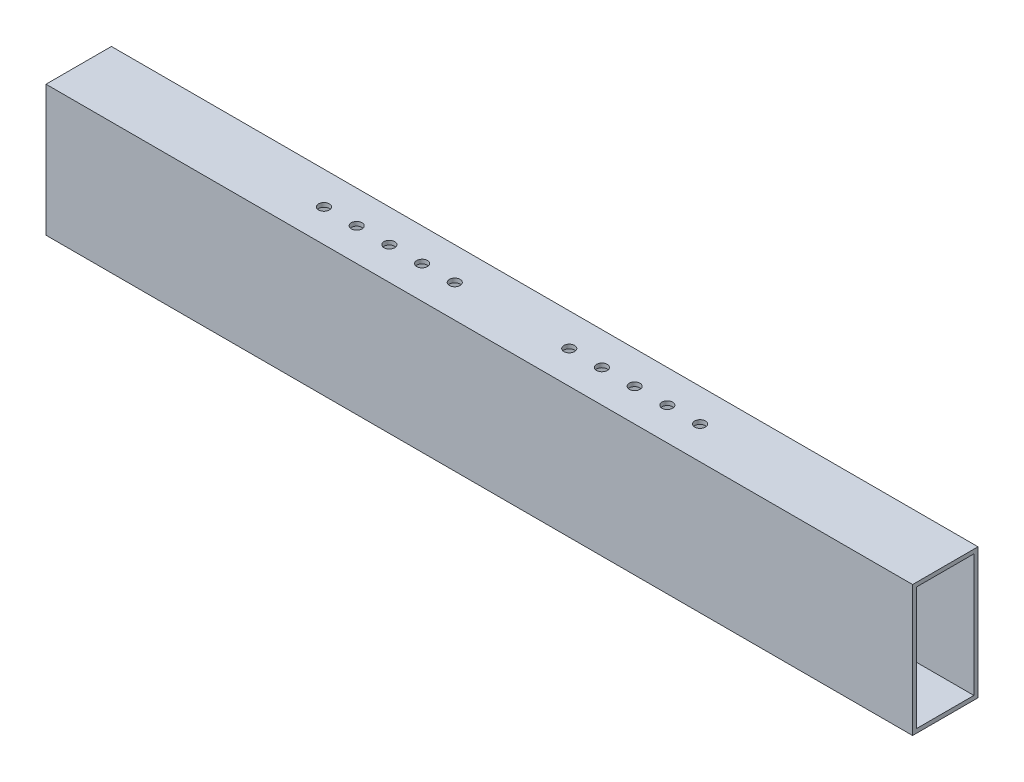
ISO-10303-21;
HEADER;
FILE_DESCRIPTION(('STEP AP214'),'2;1');
FILE_NAME('part.step','',(''),(''),'','','');
FILE_SCHEMA(('AUTOMOTIVE_DESIGN { 1 0 10303 214 1 1 1 1 }'));
ENDSEC;
DATA;
#1=APPLICATION_CONTEXT('core data for automotive mechanical design processes');
#2=APPLICATION_PROTOCOL_DEFINITION('international standard','automotive_design',2000,#1);
#3=PRODUCT_CONTEXT('',#1,'mechanical');
#4=PRODUCT('Part','Part','',(#3));
#5=PRODUCT_RELATED_PRODUCT_CATEGORY('part','',(#4));
#6=PRODUCT_DEFINITION_FORMATION('','',#4);
#7=PRODUCT_DEFINITION_CONTEXT('part definition',#1,'design');
#8=PRODUCT_DEFINITION('design','',#6,#7);
#9=PRODUCT_DEFINITION_SHAPE('','',#8);
#10=(LENGTH_UNIT() NAMED_UNIT(*) SI_UNIT(.MILLI.,.METRE.));
#11=(NAMED_UNIT(*) PLANE_ANGLE_UNIT() SI_UNIT($,.RADIAN.));
#12=(NAMED_UNIT(*) SI_UNIT($,.STERADIAN.) SOLID_ANGLE_UNIT());
#13=UNCERTAINTY_MEASURE_WITH_UNIT(LENGTH_MEASURE(1.E-05),#10,'distance_accuracy_value','');
#14=(GEOMETRIC_REPRESENTATION_CONTEXT(3) GLOBAL_UNCERTAINTY_ASSIGNED_CONTEXT((#13)) GLOBAL_UNIT_ASSIGNED_CONTEXT((#10,
#11,#12)) REPRESENTATION_CONTEXT('',''));
#15=CARTESIAN_POINT('',(0.,0.,0.));
#16=DIRECTION('',(0.,0.,1.));
#17=DIRECTION('',(1.,0.,0.));
#18=AXIS2_PLACEMENT_3D('',#15,#16,#17);
#19=CARTESIAN_POINT('',(241.3,24.7399999987,12.7));
#20=DIRECTION('',(0.,1.,0.));
#21=DIRECTION('',(0.,0.,1.));
#22=AXIS2_PLACEMENT_3D('',#19,#20,#21);
#23=CYLINDRICAL_SURFACE('',#22,2.0828);
#24=CARTESIAN_POINT('',(241.3,50.8,12.7));
#25=DIRECTION('',(0.,1.,0.));
#26=DIRECTION('',(0.,0.,1.));
#27=AXIS2_PLACEMENT_3D('',#24,#25,#26);
#28=CIRCLE('',#27,2.0828);
#29=CARTESIAN_POINT('',(241.3,50.8,14.7828));
#30=VERTEX_POINT('',#29);
#31=EDGE_CURVE('E119',#30,#30,#28,.F.);
#32=ORIENTED_EDGE('',*,*,#31,.F.);
#33=EDGE_LOOP('',(#32));
#34=FACE_BOUND('',#33,.T.);
#35=CARTESIAN_POINT('',(241.3,49.2125,12.7));
#36=DIRECTION('',(0.,1.,0.));
#37=DIRECTION('',(0.,0.,1.));
#38=AXIS2_PLACEMENT_3D('',#35,#36,#37);
#39=CIRCLE('',#38,2.0828);
#40=CARTESIAN_POINT('',(241.3,49.2125,14.7828));
#41=VERTEX_POINT('',#40);
#42=EDGE_CURVE('E124',#41,#41,#39,.F.);
#43=ORIENTED_EDGE('',*,*,#42,.T.);
#44=EDGE_LOOP('',(#43));
#45=FACE_BOUND('',#44,.T.);
#46=ADVANCED_FACE('F17',(#34,#45),#23,.F.);
#47=CARTESIAN_POINT('',(228.6,24.7399999987,12.7));
#48=DIRECTION('',(0.,1.,0.));
#49=DIRECTION('',(0.,0.,1.));
#50=AXIS2_PLACEMENT_3D('',#47,#48,#49);
#51=CYLINDRICAL_SURFACE('',#50,2.0828);
#52=CARTESIAN_POINT('',(228.6,50.8,12.7));
#53=DIRECTION('',(0.,1.,0.));
#54=DIRECTION('',(0.,0.,1.));
#55=AXIS2_PLACEMENT_3D('',#52,#53,#54);
#56=CIRCLE('',#55,2.0828);
#57=CARTESIAN_POINT('',(228.6,50.8,14.7828));
#58=VERTEX_POINT('',#57);
#59=EDGE_CURVE('E181',#58,#58,#56,.F.);
#60=ORIENTED_EDGE('',*,*,#59,.F.);
#61=EDGE_LOOP('',(#60));
#62=FACE_BOUND('',#61,.T.);
#63=CARTESIAN_POINT('',(228.6,49.2125,12.7));
#64=DIRECTION('',(0.,1.,0.));
#65=DIRECTION('',(0.,0.,1.));
#66=AXIS2_PLACEMENT_3D('',#63,#64,#65);
#67=CIRCLE('',#66,2.0828);
#68=CARTESIAN_POINT('',(228.6,49.2125,14.7828));
#69=VERTEX_POINT('',#68);
#70=EDGE_CURVE('E209',#69,#69,#67,.F.);
#71=ORIENTED_EDGE('',*,*,#70,.T.);
#72=EDGE_LOOP('',(#71));
#73=FACE_BOUND('',#72,.T.);
#74=ADVANCED_FACE('F348',(#62,#73),#51,.F.);
#75=CARTESIAN_POINT('',(215.9,24.7399999987,12.7));
#76=DIRECTION('',(0.,1.,0.));
#77=DIRECTION('',(0.,0.,1.));
#78=AXIS2_PLACEMENT_3D('',#75,#76,#77);
#79=CYLINDRICAL_SURFACE('',#78,2.0828);
#80=CARTESIAN_POINT('',(215.9,50.8,12.7));
#81=DIRECTION('',(0.,1.,0.));
#82=DIRECTION('',(0.,0.,1.));
#83=AXIS2_PLACEMENT_3D('',#80,#81,#82);
#84=CIRCLE('',#83,2.0828);
#85=CARTESIAN_POINT('',(215.9,50.8,14.7828));
#86=VERTEX_POINT('',#85);
#87=EDGE_CURVE('E178',#86,#86,#84,.F.);
#88=ORIENTED_EDGE('',*,*,#87,.F.);
#89=EDGE_LOOP('',(#88));
#90=FACE_BOUND('',#89,.T.);
#91=CARTESIAN_POINT('',(215.9,49.2125,12.7));
#92=DIRECTION('',(0.,1.,0.));
#93=DIRECTION('',(0.,0.,1.));
#94=AXIS2_PLACEMENT_3D('',#91,#92,#93);
#95=CIRCLE('',#94,2.0828);
#96=CARTESIAN_POINT('',(215.9,49.2125,14.7828));
#97=VERTEX_POINT('',#96);
#98=EDGE_CURVE('E206',#97,#97,#95,.F.);
#99=ORIENTED_EDGE('',*,*,#98,.T.);
#100=EDGE_LOOP('',(#99));
#101=FACE_BOUND('',#100,.T.);
#102=ADVANCED_FACE('F353',(#90,#101),#79,.F.);
#103=CARTESIAN_POINT('',(203.2,24.7399999987,12.7));
#104=DIRECTION('',(0.,1.,0.));
#105=DIRECTION('',(0.,0.,1.));
#106=AXIS2_PLACEMENT_3D('',#103,#104,#105);
#107=CYLINDRICAL_SURFACE('',#106,2.0828);
#108=CARTESIAN_POINT('',(203.2,50.8,12.7));
#109=DIRECTION('',(0.,1.,0.));
#110=DIRECTION('',(0.,0.,1.));
#111=AXIS2_PLACEMENT_3D('',#108,#109,#110);
#112=CIRCLE('',#111,2.0828);
#113=CARTESIAN_POINT('',(203.2,50.8,14.7828));
#114=VERTEX_POINT('',#113);
#115=EDGE_CURVE('E175',#114,#114,#112,.F.);
#116=ORIENTED_EDGE('',*,*,#115,.F.);
#117=EDGE_LOOP('',(#116));
#118=FACE_BOUND('',#117,.T.);
#119=CARTESIAN_POINT('',(203.2,49.2125,12.7));
#120=DIRECTION('',(0.,1.,0.));
#121=DIRECTION('',(0.,0.,1.));
#122=AXIS2_PLACEMENT_3D('',#119,#120,#121);
#123=CIRCLE('',#122,2.0828);
#124=CARTESIAN_POINT('',(203.2,49.2125,14.7828));
#125=VERTEX_POINT('',#124);
#126=EDGE_CURVE('E203',#125,#125,#123,.F.);
#127=ORIENTED_EDGE('',*,*,#126,.T.);
#128=EDGE_LOOP('',(#127));
#129=FACE_BOUND('',#128,.T.);
#130=ADVANCED_FACE('F360',(#118,#129),#107,.F.);
#131=CARTESIAN_POINT('',(190.5,24.7399999987,12.7));
#132=DIRECTION('',(0.,1.,0.));
#133=DIRECTION('',(0.,0.,1.));
#134=AXIS2_PLACEMENT_3D('',#131,#132,#133);
#135=CYLINDRICAL_SURFACE('',#134,2.0828);
#136=CARTESIAN_POINT('',(190.5,50.8,12.7));
#137=DIRECTION('',(0.,1.,0.));
#138=DIRECTION('',(0.,0.,1.));
#139=AXIS2_PLACEMENT_3D('',#136,#137,#138);
#140=CIRCLE('',#139,2.0828);
#141=CARTESIAN_POINT('',(190.5,50.8,14.7828));
#142=VERTEX_POINT('',#141);
#143=EDGE_CURVE('E172',#142,#142,#140,.F.);
#144=ORIENTED_EDGE('',*,*,#143,.F.);
#145=EDGE_LOOP('',(#144));
#146=FACE_BOUND('',#145,.T.);
#147=CARTESIAN_POINT('',(190.5,49.2125,12.7));
#148=DIRECTION('',(0.,1.,0.));
#149=DIRECTION('',(0.,0.,1.));
#150=AXIS2_PLACEMENT_3D('',#147,#148,#149);
#151=CIRCLE('',#150,2.0828);
#152=CARTESIAN_POINT('',(190.5,49.2125,14.7828));
#153=VERTEX_POINT('',#152);
#154=EDGE_CURVE('E200',#153,#153,#151,.F.);
#155=ORIENTED_EDGE('',*,*,#154,.T.);
#156=EDGE_LOOP('',(#155));
#157=FACE_BOUND('',#156,.T.);
#158=ADVANCED_FACE('F368',(#146,#157),#135,.F.);
#159=CARTESIAN_POINT('',(146.05,24.7399999987,12.7));
#160=DIRECTION('',(0.,1.,0.));
#161=DIRECTION('',(0.,0.,1.));
#162=AXIS2_PLACEMENT_3D('',#159,#160,#161);
#163=CYLINDRICAL_SURFACE('',#162,2.0828);
#164=CARTESIAN_POINT('',(146.05,50.8,12.7));
#165=DIRECTION('',(0.,1.,0.));
#166=DIRECTION('',(0.,0.,1.));
#167=AXIS2_PLACEMENT_3D('',#164,#165,#166);
#168=CIRCLE('',#167,2.0828);
#169=CARTESIAN_POINT('',(146.05,50.8,14.7828));
#170=VERTEX_POINT('',#169);
#171=EDGE_CURVE('E169',#170,#170,#168,.F.);
#172=ORIENTED_EDGE('',*,*,#171,.F.);
#173=EDGE_LOOP('',(#172));
#174=FACE_BOUND('',#173,.T.);
#175=CARTESIAN_POINT('',(146.05,49.2125,12.7));
#176=DIRECTION('',(0.,1.,0.));
#177=DIRECTION('',(0.,0.,1.));
#178=AXIS2_PLACEMENT_3D('',#175,#176,#177);
#179=CIRCLE('',#178,2.0828);
#180=CARTESIAN_POINT('',(146.05,49.2125,14.7828));
#181=VERTEX_POINT('',#180);
#182=EDGE_CURVE('E197',#181,#181,#179,.F.);
#183=ORIENTED_EDGE('',*,*,#182,.T.);
#184=EDGE_LOOP('',(#183));
#185=FACE_BOUND('',#184,.T.);
#186=ADVANCED_FACE('F372',(#174,#185),#163,.F.);
#187=CARTESIAN_POINT('',(133.35,24.7399999987,12.7));
#188=DIRECTION('',(0.,1.,0.));
#189=DIRECTION('',(0.,0.,1.));
#190=AXIS2_PLACEMENT_3D('',#187,#188,#189);
#191=CYLINDRICAL_SURFACE('',#190,2.0828);
#192=CARTESIAN_POINT('',(133.35,50.8,12.7));
#193=DIRECTION('',(0.,1.,0.));
#194=DIRECTION('',(0.,0.,1.));
#195=AXIS2_PLACEMENT_3D('',#192,#193,#194);
#196=CIRCLE('',#195,2.0828);
#197=CARTESIAN_POINT('',(133.35,50.8,14.7828));
#198=VERTEX_POINT('',#197);
#199=EDGE_CURVE('E166',#198,#198,#196,.F.);
#200=ORIENTED_EDGE('',*,*,#199,.F.);
#201=EDGE_LOOP('',(#200));
#202=FACE_BOUND('',#201,.T.);
#203=CARTESIAN_POINT('',(133.35,49.2125,12.7));
#204=DIRECTION('',(0.,1.,0.));
#205=DIRECTION('',(0.,0.,1.));
#206=AXIS2_PLACEMENT_3D('',#203,#204,#205);
#207=CIRCLE('',#206,2.0828);
#208=CARTESIAN_POINT('',(133.35,49.2125,14.7828));
#209=VERTEX_POINT('',#208);
#210=EDGE_CURVE('E194',#209,#209,#207,.F.);
#211=ORIENTED_EDGE('',*,*,#210,.T.);
#212=EDGE_LOOP('',(#211));
#213=FACE_BOUND('',#212,.T.);
#214=ADVANCED_FACE('F376',(#202,#213),#191,.F.);
#215=CARTESIAN_POINT('',(120.65,24.7399999987,12.7));
#216=DIRECTION('',(0.,1.,0.));
#217=DIRECTION('',(0.,0.,1.));
#218=AXIS2_PLACEMENT_3D('',#215,#216,#217);
#219=CYLINDRICAL_SURFACE('',#218,2.0828);
#220=CARTESIAN_POINT('',(120.65,50.8,12.7));
#221=DIRECTION('',(0.,1.,0.));
#222=DIRECTION('',(0.,0.,1.));
#223=AXIS2_PLACEMENT_3D('',#220,#221,#222);
#224=CIRCLE('',#223,2.0828);
#225=CARTESIAN_POINT('',(120.65,50.8,14.7828));
#226=VERTEX_POINT('',#225);
#227=EDGE_CURVE('E163',#226,#226,#224,.F.);
#228=ORIENTED_EDGE('',*,*,#227,.F.);
#229=EDGE_LOOP('',(#228));
#230=FACE_BOUND('',#229,.T.);
#231=CARTESIAN_POINT('',(120.65,49.2125,12.7));
#232=DIRECTION('',(0.,1.,0.));
#233=DIRECTION('',(0.,0.,1.));
#234=AXIS2_PLACEMENT_3D('',#231,#232,#233);
#235=CIRCLE('',#234,2.0828);
#236=CARTESIAN_POINT('',(120.65,49.2125,14.7828));
#237=VERTEX_POINT('',#236);
#238=EDGE_CURVE('E191',#237,#237,#235,.F.);
#239=ORIENTED_EDGE('',*,*,#238,.T.);
#240=EDGE_LOOP('',(#239));
#241=FACE_BOUND('',#240,.T.);
#242=ADVANCED_FACE('F380',(#230,#241),#219,.F.);
#243=CARTESIAN_POINT('',(107.95,24.7399999987,12.7));
#244=DIRECTION('',(0.,1.,0.));
#245=DIRECTION('',(0.,0.,1.));
#246=AXIS2_PLACEMENT_3D('',#243,#244,#245);
#247=CYLINDRICAL_SURFACE('',#246,2.0828);
#248=CARTESIAN_POINT('',(107.95,50.8,12.7));
#249=DIRECTION('',(0.,1.,0.));
#250=DIRECTION('',(0.,0.,1.));
#251=AXIS2_PLACEMENT_3D('',#248,#249,#250);
#252=CIRCLE('',#251,2.0828);
#253=CARTESIAN_POINT('',(107.95,50.8,14.7828));
#254=VERTEX_POINT('',#253);
#255=EDGE_CURVE('E160',#254,#254,#252,.F.);
#256=ORIENTED_EDGE('',*,*,#255,.F.);
#257=EDGE_LOOP('',(#256));
#258=FACE_BOUND('',#257,.T.);
#259=CARTESIAN_POINT('',(107.95,49.2125,12.7));
#260=DIRECTION('',(0.,1.,0.));
#261=DIRECTION('',(0.,0.,1.));
#262=AXIS2_PLACEMENT_3D('',#259,#260,#261);
#263=CIRCLE('',#262,2.0828);
#264=CARTESIAN_POINT('',(107.95,49.2125,14.7828));
#265=VERTEX_POINT('',#264);
#266=EDGE_CURVE('E188',#265,#265,#263,.F.);
#267=ORIENTED_EDGE('',*,*,#266,.T.);
#268=EDGE_LOOP('',(#267));
#269=FACE_BOUND('',#268,.T.);
#270=ADVANCED_FACE('F384',(#258,#269),#247,.F.);
#271=CARTESIAN_POINT('',(95.25,24.7399999987,12.7));
#272=DIRECTION('',(0.,1.,0.));
#273=DIRECTION('',(0.,0.,1.));
#274=AXIS2_PLACEMENT_3D('',#271,#272,#273);
#275=CYLINDRICAL_SURFACE('',#274,2.0828);
#276=CARTESIAN_POINT('',(95.25,50.8,12.7));
#277=DIRECTION('',(0.,1.,0.));
#278=DIRECTION('',(0.,0.,1.));
#279=AXIS2_PLACEMENT_3D('',#276,#277,#278);
#280=CIRCLE('',#279,2.0828);
#281=CARTESIAN_POINT('',(95.25,50.8,14.7828));
#282=VERTEX_POINT('',#281);
#283=EDGE_CURVE('E115',#282,#282,#280,.F.);
#284=ORIENTED_EDGE('',*,*,#283,.F.);
#285=EDGE_LOOP('',(#284));
#286=FACE_BOUND('',#285,.T.);
#287=CARTESIAN_POINT('',(95.25,49.2125,12.7));
#288=DIRECTION('',(0.,1.,0.));
#289=DIRECTION('',(0.,0.,1.));
#290=AXIS2_PLACEMENT_3D('',#287,#288,#289);
#291=CIRCLE('',#290,2.0828);
#292=CARTESIAN_POINT('',(95.25,49.2125,14.7828));
#293=VERTEX_POINT('',#292);
#294=EDGE_CURVE('E123',#293,#293,#291,.F.);
#295=ORIENTED_EDGE('',*,*,#294,.T.);
#296=EDGE_LOOP('',(#295));
#297=FACE_BOUND('',#296,.T.);
#298=ADVANCED_FACE('F388',(#286,#297),#275,.F.);
#299=CARTESIAN_POINT('',(241.3,24.7399999987,12.7));
#300=DIRECTION('',(0.,1.,0.));
#301=DIRECTION('',(0.,0.,1.));
#302=AXIS2_PLACEMENT_3D('',#299,#300,#301);
#303=CYLINDRICAL_SURFACE('',#302,2.0828);
#304=CARTESIAN_POINT('',(241.3,0.,12.7));
#305=DIRECTION('',(0.,1.,0.));
#306=DIRECTION('',(0.,0.,1.));
#307=AXIS2_PLACEMENT_3D('',#304,#305,#306);
#308=CIRCLE('',#307,2.0828);
#309=CARTESIAN_POINT('',(241.3,0.,14.7828));
#310=VERTEX_POINT('',#309);
#311=EDGE_CURVE('E154',#310,#310,#308,.T.);
#312=ORIENTED_EDGE('',*,*,#311,.F.);
#313=EDGE_LOOP('',(#312));
#314=FACE_BOUND('',#313,.T.);
#315=CARTESIAN_POINT('',(241.3,1.5875,12.7));
#316=DIRECTION('',(0.,1.,0.));
#317=DIRECTION('',(0.,0.,1.));
#318=AXIS2_PLACEMENT_3D('',#315,#316,#317);
#319=CIRCLE('',#318,2.0828);
#320=CARTESIAN_POINT('',(241.3,1.5875,14.7828));
#321=VERTEX_POINT('',#320);
#322=EDGE_CURVE('E20',#321,#321,#319,.T.);
#323=ORIENTED_EDGE('',*,*,#322,.T.);
#324=EDGE_LOOP('',(#323));
#325=FACE_BOUND('',#324,.T.);
#326=ADVANCED_FACE('F243',(#314,#325),#303,.F.);
#327=CARTESIAN_POINT('',(228.6,24.7399999987,12.7));
#328=DIRECTION('',(0.,1.,0.));
#329=DIRECTION('',(0.,0.,1.));
#330=AXIS2_PLACEMENT_3D('',#327,#328,#329);
#331=CYLINDRICAL_SURFACE('',#330,2.0828);
#332=CARTESIAN_POINT('',(228.6,0.,12.7));
#333=DIRECTION('',(0.,1.,0.));
#334=DIRECTION('',(0.,0.,1.));
#335=AXIS2_PLACEMENT_3D('',#332,#333,#334);
#336=CIRCLE('',#335,2.0828);
#337=CARTESIAN_POINT('',(228.6,0.,14.7828));
#338=VERTEX_POINT('',#337);
#339=EDGE_CURVE('E151',#338,#338,#336,.T.);
#340=ORIENTED_EDGE('',*,*,#339,.F.);
#341=EDGE_LOOP('',(#340));
#342=FACE_BOUND('',#341,.T.);
#343=CARTESIAN_POINT('',(228.6,1.5875,12.7));
#344=DIRECTION('',(0.,1.,0.));
#345=DIRECTION('',(0.,0.,1.));
#346=AXIS2_PLACEMENT_3D('',#343,#344,#345);
#347=CIRCLE('',#346,2.0828);
#348=CARTESIAN_POINT('',(228.6,1.5875,14.7828));
#349=VERTEX_POINT('',#348);
#350=EDGE_CURVE('E236',#349,#349,#347,.T.);
#351=ORIENTED_EDGE('',*,*,#350,.T.);
#352=EDGE_LOOP('',(#351));
#353=FACE_BOUND('',#352,.T.);
#354=ADVANCED_FACE('F395',(#342,#353),#331,.F.);
#355=CARTESIAN_POINT('',(215.9,24.7399999987,12.7));
#356=DIRECTION('',(0.,1.,0.));
#357=DIRECTION('',(0.,0.,1.));
#358=AXIS2_PLACEMENT_3D('',#355,#356,#357);
#359=CYLINDRICAL_SURFACE('',#358,2.0828);
#360=CARTESIAN_POINT('',(215.9,0.,12.7));
#361=DIRECTION('',(0.,1.,0.));
#362=DIRECTION('',(0.,0.,1.));
#363=AXIS2_PLACEMENT_3D('',#360,#361,#362);
#364=CIRCLE('',#363,2.0828);
#365=CARTESIAN_POINT('',(215.9,0.,14.7828));
#366=VERTEX_POINT('',#365);
#367=EDGE_CURVE('E148',#366,#366,#364,.T.);
#368=ORIENTED_EDGE('',*,*,#367,.F.);
#369=EDGE_LOOP('',(#368));
#370=FACE_BOUND('',#369,.T.);
#371=CARTESIAN_POINT('',(215.9,1.5875,12.7));
#372=DIRECTION('',(0.,1.,0.));
#373=DIRECTION('',(0.,0.,1.));
#374=AXIS2_PLACEMENT_3D('',#371,#372,#373);
#375=CIRCLE('',#374,2.0828);
#376=CARTESIAN_POINT('',(215.9,1.5875,14.7828));
#377=VERTEX_POINT('',#376);
#378=EDGE_CURVE('E234',#377,#377,#375,.T.);
#379=ORIENTED_EDGE('',*,*,#378,.T.);
#380=EDGE_LOOP('',(#379));
#381=FACE_BOUND('',#380,.T.);
#382=ADVANCED_FACE('F399',(#370,#381),#359,.F.);
#383=CARTESIAN_POINT('',(203.2,24.7399999987,12.7));
#384=DIRECTION('',(0.,1.,0.));
#385=DIRECTION('',(0.,0.,1.));
#386=AXIS2_PLACEMENT_3D('',#383,#384,#385);
#387=CYLINDRICAL_SURFACE('',#386,2.0828);
#388=CARTESIAN_POINT('',(203.2,0.,12.7));
#389=DIRECTION('',(0.,1.,0.));
#390=DIRECTION('',(0.,0.,1.));
#391=AXIS2_PLACEMENT_3D('',#388,#389,#390);
#392=CIRCLE('',#391,2.0828);
#393=CARTESIAN_POINT('',(203.2,0.,14.7828));
#394=VERTEX_POINT('',#393);
#395=EDGE_CURVE('E145',#394,#394,#392,.T.);
#396=ORIENTED_EDGE('',*,*,#395,.F.);
#397=EDGE_LOOP('',(#396));
#398=FACE_BOUND('',#397,.T.);
#399=CARTESIAN_POINT('',(203.2,1.5875,12.7));
#400=DIRECTION('',(0.,1.,0.));
#401=DIRECTION('',(0.,0.,1.));
#402=AXIS2_PLACEMENT_3D('',#399,#400,#401);
#403=CIRCLE('',#402,2.0828);
#404=CARTESIAN_POINT('',(203.2,1.5875,14.7828));
#405=VERTEX_POINT('',#404);
#406=EDGE_CURVE('E231',#405,#405,#403,.T.);
#407=ORIENTED_EDGE('',*,*,#406,.T.);
#408=EDGE_LOOP('',(#407));
#409=FACE_BOUND('',#408,.T.);
#410=ADVANCED_FACE('F403',(#398,#409),#387,.F.);
#411=CARTESIAN_POINT('',(190.5,24.7399999987,12.7));
#412=DIRECTION('',(0.,1.,0.));
#413=DIRECTION('',(0.,0.,1.));
#414=AXIS2_PLACEMENT_3D('',#411,#412,#413);
#415=CYLINDRICAL_SURFACE('',#414,2.0828);
#416=CARTESIAN_POINT('',(190.5,0.,12.7));
#417=DIRECTION('',(0.,1.,0.));
#418=DIRECTION('',(0.,0.,1.));
#419=AXIS2_PLACEMENT_3D('',#416,#417,#418);
#420=CIRCLE('',#419,2.0828);
#421=CARTESIAN_POINT('',(190.5,0.,14.7828));
#422=VERTEX_POINT('',#421);
#423=EDGE_CURVE('E142',#422,#422,#420,.T.);
#424=ORIENTED_EDGE('',*,*,#423,.F.);
#425=EDGE_LOOP('',(#424));
#426=FACE_BOUND('',#425,.T.);
#427=CARTESIAN_POINT('',(190.5,1.5875,12.7));
#428=DIRECTION('',(0.,1.,0.));
#429=DIRECTION('',(0.,0.,1.));
#430=AXIS2_PLACEMENT_3D('',#427,#428,#429);
#431=CIRCLE('',#430,2.0828);
#432=CARTESIAN_POINT('',(190.5,1.5875,14.7828));
#433=VERTEX_POINT('',#432);
#434=EDGE_CURVE('E228',#433,#433,#431,.T.);
#435=ORIENTED_EDGE('',*,*,#434,.T.);
#436=EDGE_LOOP('',(#435));
#437=FACE_BOUND('',#436,.T.);
#438=ADVANCED_FACE('F407',(#426,#437),#415,.F.);
#439=CARTESIAN_POINT('',(146.05,24.7399999987,12.7));
#440=DIRECTION('',(0.,1.,0.));
#441=DIRECTION('',(0.,0.,1.));
#442=AXIS2_PLACEMENT_3D('',#439,#440,#441);
#443=CYLINDRICAL_SURFACE('',#442,2.0828);
#444=CARTESIAN_POINT('',(146.05,0.,12.7));
#445=DIRECTION('',(0.,1.,0.));
#446=DIRECTION('',(0.,0.,1.));
#447=AXIS2_PLACEMENT_3D('',#444,#445,#446);
#448=CIRCLE('',#447,2.0828);
#449=CARTESIAN_POINT('',(146.05,0.,14.7828));
#450=VERTEX_POINT('',#449);
#451=EDGE_CURVE('E139',#450,#450,#448,.T.);
#452=ORIENTED_EDGE('',*,*,#451,.F.);
#453=EDGE_LOOP('',(#452));
#454=FACE_BOUND('',#453,.T.);
#455=CARTESIAN_POINT('',(146.05,1.5875,12.7));
#456=DIRECTION('',(0.,1.,0.));
#457=DIRECTION('',(0.,0.,1.));
#458=AXIS2_PLACEMENT_3D('',#455,#456,#457);
#459=CIRCLE('',#458,2.0828);
#460=CARTESIAN_POINT('',(146.05,1.5875,14.7828));
#461=VERTEX_POINT('',#460);
#462=EDGE_CURVE('E225',#461,#461,#459,.T.);
#463=ORIENTED_EDGE('',*,*,#462,.T.);
#464=EDGE_LOOP('',(#463));
#465=FACE_BOUND('',#464,.T.);
#466=ADVANCED_FACE('F411',(#454,#465),#443,.F.);
#467=CARTESIAN_POINT('',(133.35,24.7399999987,12.7));
#468=DIRECTION('',(0.,1.,0.));
#469=DIRECTION('',(0.,0.,1.));
#470=AXIS2_PLACEMENT_3D('',#467,#468,#469);
#471=CYLINDRICAL_SURFACE('',#470,2.0828);
#472=CARTESIAN_POINT('',(133.35,0.,12.7));
#473=DIRECTION('',(0.,1.,0.));
#474=DIRECTION('',(0.,0.,1.));
#475=AXIS2_PLACEMENT_3D('',#472,#473,#474);
#476=CIRCLE('',#475,2.0828);
#477=CARTESIAN_POINT('',(133.35,0.,14.7828));
#478=VERTEX_POINT('',#477);
#479=EDGE_CURVE('E136',#478,#478,#476,.T.);
#480=ORIENTED_EDGE('',*,*,#479,.F.);
#481=EDGE_LOOP('',(#480));
#482=FACE_BOUND('',#481,.T.);
#483=CARTESIAN_POINT('',(133.35,1.5875,12.7));
#484=DIRECTION('',(0.,1.,0.));
#485=DIRECTION('',(0.,0.,1.));
#486=AXIS2_PLACEMENT_3D('',#483,#484,#485);
#487=CIRCLE('',#486,2.0828);
#488=CARTESIAN_POINT('',(133.35,1.5875,14.7828));
#489=VERTEX_POINT('',#488);
#490=EDGE_CURVE('E222',#489,#489,#487,.T.);
#491=ORIENTED_EDGE('',*,*,#490,.T.);
#492=EDGE_LOOP('',(#491));
#493=FACE_BOUND('',#492,.T.);
#494=ADVANCED_FACE('F415',(#482,#493),#471,.F.);
#495=CARTESIAN_POINT('',(120.65,24.7399999987,12.7));
#496=DIRECTION('',(0.,1.,0.));
#497=DIRECTION('',(0.,0.,1.));
#498=AXIS2_PLACEMENT_3D('',#495,#496,#497);
#499=CYLINDRICAL_SURFACE('',#498,2.0828);
#500=CARTESIAN_POINT('',(120.65,0.,12.7));
#501=DIRECTION('',(0.,1.,0.));
#502=DIRECTION('',(0.,0.,1.));
#503=AXIS2_PLACEMENT_3D('',#500,#501,#502);
#504=CIRCLE('',#503,2.0828);
#505=CARTESIAN_POINT('',(120.65,0.,14.7828));
#506=VERTEX_POINT('',#505);
#507=EDGE_CURVE('E133',#506,#506,#504,.T.);
#508=ORIENTED_EDGE('',*,*,#507,.F.);
#509=EDGE_LOOP('',(#508));
#510=FACE_BOUND('',#509,.T.);
#511=CARTESIAN_POINT('',(120.65,1.5875,12.7));
#512=DIRECTION('',(0.,1.,0.));
#513=DIRECTION('',(0.,0.,1.));
#514=AXIS2_PLACEMENT_3D('',#511,#512,#513);
#515=CIRCLE('',#514,2.0828);
#516=CARTESIAN_POINT('',(120.65,1.5875,14.7828));
#517=VERTEX_POINT('',#516);
#518=EDGE_CURVE('E219',#517,#517,#515,.T.);
#519=ORIENTED_EDGE('',*,*,#518,.T.);
#520=EDGE_LOOP('',(#519));
#521=FACE_BOUND('',#520,.T.);
#522=ADVANCED_FACE('F419',(#510,#521),#499,.F.);
#523=CARTESIAN_POINT('',(107.95,24.7399999987,12.7));
#524=DIRECTION('',(0.,1.,0.));
#525=DIRECTION('',(0.,0.,1.));
#526=AXIS2_PLACEMENT_3D('',#523,#524,#525);
#527=CYLINDRICAL_SURFACE('',#526,2.0828);
#528=CARTESIAN_POINT('',(107.95,0.,12.7));
#529=DIRECTION('',(0.,1.,0.));
#530=DIRECTION('',(0.,0.,1.));
#531=AXIS2_PLACEMENT_3D('',#528,#529,#530);
#532=CIRCLE('',#531,2.0828);
#533=CARTESIAN_POINT('',(107.95,0.,14.7828));
#534=VERTEX_POINT('',#533);
#535=EDGE_CURVE('E130',#534,#534,#532,.T.);
#536=ORIENTED_EDGE('',*,*,#535,.F.);
#537=EDGE_LOOP('',(#536));
#538=FACE_BOUND('',#537,.T.);
#539=CARTESIAN_POINT('',(107.95,1.5875,12.7));
#540=DIRECTION('',(0.,1.,0.));
#541=DIRECTION('',(0.,0.,1.));
#542=AXIS2_PLACEMENT_3D('',#539,#540,#541);
#543=CIRCLE('',#542,2.0828);
#544=CARTESIAN_POINT('',(107.95,1.5875,14.7828));
#545=VERTEX_POINT('',#544);
#546=EDGE_CURVE('E216',#545,#545,#543,.T.);
#547=ORIENTED_EDGE('',*,*,#546,.T.);
#548=EDGE_LOOP('',(#547));
#549=FACE_BOUND('',#548,.T.);
#550=ADVANCED_FACE('F423',(#538,#549),#527,.F.);
#551=CARTESIAN_POINT('',(95.25,24.7399999987,12.7));
#552=DIRECTION('',(0.,1.,0.));
#553=DIRECTION('',(0.,0.,1.));
#554=AXIS2_PLACEMENT_3D('',#551,#552,#553);
#555=CYLINDRICAL_SURFACE('',#554,2.0828);
#556=CARTESIAN_POINT('',(95.25,0.,12.7));
#557=DIRECTION('',(0.,1.,0.));
#558=DIRECTION('',(0.,0.,1.));
#559=AXIS2_PLACEMENT_3D('',#556,#557,#558);
#560=CIRCLE('',#559,2.0828);
#561=CARTESIAN_POINT('',(95.25,0.,14.7828));
#562=VERTEX_POINT('',#561);
#563=EDGE_CURVE('E126',#562,#562,#560,.T.);
#564=ORIENTED_EDGE('',*,*,#563,.F.);
#565=EDGE_LOOP('',(#564));
#566=FACE_BOUND('',#565,.T.);
#567=CARTESIAN_POINT('',(95.25,1.5875,12.7));
#568=DIRECTION('',(0.,1.,0.));
#569=DIRECTION('',(0.,0.,1.));
#570=AXIS2_PLACEMENT_3D('',#567,#568,#569);
#571=CIRCLE('',#570,2.0828);
#572=CARTESIAN_POINT('',(95.25,1.5875,14.7828));
#573=VERTEX_POINT('',#572);
#574=EDGE_CURVE('E100',#573,#573,#571,.T.);
#575=ORIENTED_EDGE('',*,*,#574,.T.);
#576=EDGE_LOOP('',(#575));
#577=FACE_BOUND('',#576,.T.);
#578=ADVANCED_FACE('F256',(#566,#577),#555,.F.);
#579=CARTESIAN_POINT('',(0.,0.,0.));
#580=DIRECTION('',(0.,0.,-1.));
#581=DIRECTION('',(-1.,0.,0.));
#582=AXIS2_PLACEMENT_3D('',#579,#580,#581);
#583=PLANE('',#582);
#584=DIRECTION('',(1.,0.,0.));
#585=VECTOR('',#584,1.);
#586=CARTESIAN_POINT('',(0.,50.8,0.));
#587=LINE('',#586,#585);
#588=CARTESIAN_POINT('',(336.55,50.8,0.));
#589=VERTEX_POINT('',#588);
#590=CARTESIAN_POINT('',(0.,50.8,0.));
#591=VERTEX_POINT('',#590);
#592=EDGE_CURVE('E116',#589,#591,#587,.F.);
#593=ORIENTED_EDGE('',*,*,#592,.F.);
#594=DIRECTION('',(0.,1.,0.));
#595=VECTOR('',#594,1.);
#596=CARTESIAN_POINT('',(336.55,0.,0.));
#597=LINE('',#596,#595);
#598=CARTESIAN_POINT('',(336.55,0.,0.));
#599=VERTEX_POINT('',#598);
#600=EDGE_CURVE('E129',#599,#589,#597,.T.);
#601=ORIENTED_EDGE('',*,*,#600,.F.);
#602=DIRECTION('',(1.,0.,0.));
#603=VECTOR('',#602,1.);
#604=CARTESIAN_POINT('',(0.,0.,0.));
#605=LINE('',#604,#603);
#606=CARTESIAN_POINT('',(0.,0.,0.));
#607=VERTEX_POINT('',#606);
#608=EDGE_CURVE('E157',#607,#599,#605,.T.);
#609=ORIENTED_EDGE('',*,*,#608,.F.);
#610=DIRECTION('',(0.,1.,0.));
#611=VECTOR('',#610,1.);
#612=CARTESIAN_POINT('',(0.,0.,0.));
#613=LINE('',#612,#611);
#614=EDGE_CURVE('E112',#607,#591,#613,.T.);
#615=ORIENTED_EDGE('',*,*,#614,.T.);
#616=EDGE_LOOP('',(#593,#601,#609,#615));
#617=FACE_BOUND('',#616,.T.);
#618=ADVANCED_FACE('F246',(#617),#583,.T.);
#619=CARTESIAN_POINT('',(0.,1.5875,23.8125));
#620=DIRECTION('',(0.,-1.,0.));
#621=DIRECTION('',(0.,0.,-1.));
#622=AXIS2_PLACEMENT_3D('',#619,#620,#621);
#623=PLANE('',#622);
#624=ORIENTED_EDGE('',*,*,#574,.F.);
#625=EDGE_LOOP('',(#624));
#626=FACE_BOUND('',#625,.T.);
#627=ORIENTED_EDGE('',*,*,#546,.F.);
#628=EDGE_LOOP('',(#627));
#629=FACE_BOUND('',#628,.T.);
#630=ORIENTED_EDGE('',*,*,#518,.F.);
#631=EDGE_LOOP('',(#630));
#632=FACE_BOUND('',#631,.T.);
#633=ORIENTED_EDGE('',*,*,#490,.F.);
#634=EDGE_LOOP('',(#633));
#635=FACE_BOUND('',#634,.T.);
#636=ORIENTED_EDGE('',*,*,#462,.F.);
#637=EDGE_LOOP('',(#636));
#638=FACE_BOUND('',#637,.T.);
#639=ORIENTED_EDGE('',*,*,#434,.F.);
#640=EDGE_LOOP('',(#639));
#641=FACE_BOUND('',#640,.T.);
#642=ORIENTED_EDGE('',*,*,#406,.F.);
#643=EDGE_LOOP('',(#642));
#644=FACE_BOUND('',#643,.T.);
#645=ORIENTED_EDGE('',*,*,#378,.F.);
#646=EDGE_LOOP('',(#645));
#647=FACE_BOUND('',#646,.T.);
#648=ORIENTED_EDGE('',*,*,#350,.F.);
#649=EDGE_LOOP('',(#648));
#650=FACE_BOUND('',#649,.T.);
#651=ORIENTED_EDGE('',*,*,#322,.F.);
#652=EDGE_LOOP('',(#651));
#653=FACE_BOUND('',#652,.T.);
#654=DIRECTION('',(-1.,0.,0.));
#655=VECTOR('',#654,1.);
#656=CARTESIAN_POINT('',(0.,1.5875,1.5875));
#657=LINE('',#656,#655);
#658=CARTESIAN_POINT('',(336.55,1.5875,1.5875));
#659=VERTEX_POINT('',#658);
#660=CARTESIAN_POINT('',(0.,1.5875,1.5875));
#661=VERTEX_POINT('',#660);
#662=EDGE_CURVE('E85',#659,#661,#657,.T.);
#663=ORIENTED_EDGE('',*,*,#662,.T.);
#664=DIRECTION('',(0.,0.,-1.));
#665=VECTOR('',#664,1.);
#666=CARTESIAN_POINT('',(0.,1.5875,0.));
#667=LINE('',#666,#665);
#668=CARTESIAN_POINT('',(0.,1.5875,23.8125));
#669=VERTEX_POINT('',#668);
#670=EDGE_CURVE('E79',#661,#669,#667,.F.);
#671=ORIENTED_EDGE('',*,*,#670,.T.);
#672=DIRECTION('',(1.,0.,0.));
#673=VECTOR('',#672,1.);
#674=CARTESIAN_POINT('',(0.,1.5875,23.8125));
#675=LINE('',#674,#673);
#676=CARTESIAN_POINT('',(336.55,1.5875,23.8125));
#677=VERTEX_POINT('',#676);
#678=EDGE_CURVE('E82',#669,#677,#675,.T.);
#679=ORIENTED_EDGE('',*,*,#678,.T.);
#680=DIRECTION('',(0.,0.,-1.));
#681=VECTOR('',#680,1.);
#682=CARTESIAN_POINT('',(336.55,1.5875,0.));
#683=LINE('',#682,#681);
#684=EDGE_CURVE('E320',#659,#677,#683,.F.);
#685=ORIENTED_EDGE('',*,*,#684,.F.);
#686=EDGE_LOOP('',(#663,#671,#679,#685));
#687=FACE_BOUND('',#686,.T.);
#688=ADVANCED_FACE('F81',(#626,#629,#632,#635,#638,#641,#644,#647,#650,#653,#687),#623,.F.);
#689=CARTESIAN_POINT('',(0.,49.2125,23.8125));
#690=DIRECTION('',(0.,0.,1.));
#691=DIRECTION('',(1.,0.,0.));
#692=AXIS2_PLACEMENT_3D('',#689,#690,#691);
#693=PLANE('',#692);
#694=ORIENTED_EDGE('',*,*,#678,.F.);
#695=DIRECTION('',(0.,1.,0.));
#696=VECTOR('',#695,1.);
#697=CARTESIAN_POINT('',(0.,0.,23.8125));
#698=LINE('',#697,#696);
#699=CARTESIAN_POINT('',(0.,49.2125,23.8125));
#700=VERTEX_POINT('',#699);
#701=EDGE_CURVE('E90',#669,#700,#698,.T.);
#702=ORIENTED_EDGE('',*,*,#701,.T.);
#703=DIRECTION('',(1.,0.,0.));
#704=VECTOR('',#703,1.);
#705=CARTESIAN_POINT('',(0.,49.2125,23.8125));
#706=LINE('',#705,#704);
#707=CARTESIAN_POINT('',(336.55,49.2125,23.8125));
#708=VERTEX_POINT('',#707);
#709=EDGE_CURVE('E99',#700,#708,#706,.T.);
#710=ORIENTED_EDGE('',*,*,#709,.T.);
#711=DIRECTION('',(0.,1.,0.));
#712=VECTOR('',#711,1.);
#713=CARTESIAN_POINT('',(336.55,0.,23.8125));
#714=LINE('',#713,#712);
#715=EDGE_CURVE('E97',#677,#708,#714,.T.);
#716=ORIENTED_EDGE('',*,*,#715,.F.);
#717=EDGE_LOOP('',(#694,#702,#710,#716));
#718=FACE_BOUND('',#717,.T.);
#719=ADVANCED_FACE('F94',(#718),#693,.F.);
#720=CARTESIAN_POINT('',(0.,49.2125,1.5875));
#721=DIRECTION('',(0.,1.,0.));
#722=DIRECTION('',(0.,0.,1.));
#723=AXIS2_PLACEMENT_3D('',#720,#721,#722);
#724=PLANE('',#723);
#725=ORIENTED_EDGE('',*,*,#294,.F.);
#726=EDGE_LOOP('',(#725));
#727=FACE_BOUND('',#726,.T.);
#728=ORIENTED_EDGE('',*,*,#266,.F.);
#729=EDGE_LOOP('',(#728));
#730=FACE_BOUND('',#729,.T.);
#731=ORIENTED_EDGE('',*,*,#238,.F.);
#732=EDGE_LOOP('',(#731));
#733=FACE_BOUND('',#732,.T.);
#734=ORIENTED_EDGE('',*,*,#210,.F.);
#735=EDGE_LOOP('',(#734));
#736=FACE_BOUND('',#735,.T.);
#737=ORIENTED_EDGE('',*,*,#182,.F.);
#738=EDGE_LOOP('',(#737));
#739=FACE_BOUND('',#738,.T.);
#740=ORIENTED_EDGE('',*,*,#154,.F.);
#741=EDGE_LOOP('',(#740));
#742=FACE_BOUND('',#741,.T.);
#743=ORIENTED_EDGE('',*,*,#126,.F.);
#744=EDGE_LOOP('',(#743));
#745=FACE_BOUND('',#744,.T.);
#746=ORIENTED_EDGE('',*,*,#98,.F.);
#747=EDGE_LOOP('',(#746));
#748=FACE_BOUND('',#747,.T.);
#749=ORIENTED_EDGE('',*,*,#70,.F.);
#750=EDGE_LOOP('',(#749));
#751=FACE_BOUND('',#750,.T.);
#752=ORIENTED_EDGE('',*,*,#42,.F.);
#753=EDGE_LOOP('',(#752));
#754=FACE_BOUND('',#753,.T.);
#755=ORIENTED_EDGE('',*,*,#709,.F.);
#756=DIRECTION('',(0.,0.,-1.));
#757=VECTOR('',#756,1.);
#758=CARTESIAN_POINT('',(0.,49.2125,0.));
#759=LINE('',#758,#757);
#760=CARTESIAN_POINT('',(0.,49.2125,1.5875));
#761=VERTEX_POINT('',#760);
#762=EDGE_CURVE('E105',#700,#761,#759,.T.);
#763=ORIENTED_EDGE('',*,*,#762,.T.);
#764=DIRECTION('',(-1.,0.,0.));
#765=VECTOR('',#764,1.);
#766=CARTESIAN_POINT('',(0.,49.2125,1.5875));
#767=LINE('',#766,#765);
#768=CARTESIAN_POINT('',(336.55,49.2125,1.5875));
#769=VERTEX_POINT('',#768);
#770=EDGE_CURVE('E120',#761,#769,#767,.F.);
#771=ORIENTED_EDGE('',*,*,#770,.T.);
#772=DIRECTION('',(0.,0.,-1.));
#773=VECTOR('',#772,1.);
#774=CARTESIAN_POINT('',(336.55,49.2125,0.));
#775=LINE('',#774,#773);
#776=EDGE_CURVE('E314',#708,#769,#775,.T.);
#777=ORIENTED_EDGE('',*,*,#776,.F.);
#778=EDGE_LOOP('',(#755,#763,#771,#777));
#779=FACE_BOUND('',#778,.T.);
#780=ADVANCED_FACE('F254',(#727,#730,#733,#736,#739,#742,#745,#748,#751,#754,#779),#724,.F.);
#781=CARTESIAN_POINT('',(0.,1.5875,1.5875));
#782=DIRECTION('',(0.,0.,-1.));
#783=DIRECTION('',(-1.,0.,0.));
#784=AXIS2_PLACEMENT_3D('',#781,#782,#783);
#785=PLANE('',#784);
#786=ORIENTED_EDGE('',*,*,#770,.F.);
#787=DIRECTION('',(0.,1.,0.));
#788=VECTOR('',#787,1.);
#789=CARTESIAN_POINT('',(0.,0.,1.5875));
#790=LINE('',#789,#788);
#791=EDGE_CURVE('E107',#761,#661,#790,.F.);
#792=ORIENTED_EDGE('',*,*,#791,.T.);
#793=ORIENTED_EDGE('',*,*,#662,.F.);
#794=DIRECTION('',(0.,1.,0.));
#795=VECTOR('',#794,1.);
#796=CARTESIAN_POINT('',(336.55,0.,1.5875));
#797=LINE('',#796,#795);
#798=EDGE_CURVE('E317',#769,#659,#797,.F.);
#799=ORIENTED_EDGE('',*,*,#798,.F.);
#800=EDGE_LOOP('',(#786,#792,#793,#799));
#801=FACE_BOUND('',#800,.T.);
#802=ADVANCED_FACE('F282',(#801),#785,.F.);
#803=CARTESIAN_POINT('',(0.,50.8,0.));
#804=DIRECTION('',(0.,1.,0.));
#805=DIRECTION('',(0.,0.,1.));
#806=AXIS2_PLACEMENT_3D('',#803,#804,#805);
#807=PLANE('',#806);
#808=ORIENTED_EDGE('',*,*,#283,.T.);
#809=EDGE_LOOP('',(#808));
#810=FACE_BOUND('',#809,.T.);
#811=ORIENTED_EDGE('',*,*,#255,.T.);
#812=EDGE_LOOP('',(#811));
#813=FACE_BOUND('',#812,.T.);
#814=ORIENTED_EDGE('',*,*,#227,.T.);
#815=EDGE_LOOP('',(#814));
#816=FACE_BOUND('',#815,.T.);
#817=ORIENTED_EDGE('',*,*,#199,.T.);
#818=EDGE_LOOP('',(#817));
#819=FACE_BOUND('',#818,.T.);
#820=ORIENTED_EDGE('',*,*,#171,.T.);
#821=EDGE_LOOP('',(#820));
#822=FACE_BOUND('',#821,.T.);
#823=ORIENTED_EDGE('',*,*,#143,.T.);
#824=EDGE_LOOP('',(#823));
#825=FACE_BOUND('',#824,.T.);
#826=ORIENTED_EDGE('',*,*,#115,.T.);
#827=EDGE_LOOP('',(#826));
#828=FACE_BOUND('',#827,.T.);
#829=ORIENTED_EDGE('',*,*,#87,.T.);
#830=EDGE_LOOP('',(#829));
#831=FACE_BOUND('',#830,.T.);
#832=ORIENTED_EDGE('',*,*,#59,.T.);
#833=EDGE_LOOP('',(#832));
#834=FACE_BOUND('',#833,.T.);
#835=ORIENTED_EDGE('',*,*,#31,.T.);
#836=EDGE_LOOP('',(#835));
#837=FACE_BOUND('',#836,.T.);
#838=DIRECTION('',(1.,0.,0.));
#839=VECTOR('',#838,1.);
#840=CARTESIAN_POINT('',(0.,50.8,25.4));
#841=LINE('',#840,#839);
#842=CARTESIAN_POINT('',(336.55,50.8,25.4));
#843=VERTEX_POINT('',#842);
#844=CARTESIAN_POINT('',(0.,50.8,25.4));
#845=VERTEX_POINT('',#844);
#846=EDGE_CURVE('E334',#843,#845,#841,.F.);
#847=ORIENTED_EDGE('',*,*,#846,.F.);
#848=DIRECTION('',(0.,0.,-1.));
#849=VECTOR('',#848,1.);
#850=CARTESIAN_POINT('',(336.55,50.8,0.));
#851=LINE('',#850,#849);
#852=EDGE_CURVE('E326',#589,#843,#851,.F.);
#853=ORIENTED_EDGE('',*,*,#852,.F.);
#854=ORIENTED_EDGE('',*,*,#592,.T.);
#855=DIRECTION('',(0.,0.,-1.));
#856=VECTOR('',#855,1.);
#857=CARTESIAN_POINT('',(0.,50.8,0.));
#858=LINE('',#857,#856);
#859=EDGE_CURVE('E91',#591,#845,#858,.F.);
#860=ORIENTED_EDGE('',*,*,#859,.T.);
#861=EDGE_LOOP('',(#847,#853,#854,#860));
#862=FACE_BOUND('',#861,.T.);
#863=ADVANCED_FACE('F279',(#810,#813,#816,#819,#822,#825,#828,#831,#834,#837,#862),#807,.T.);
#864=CARTESIAN_POINT('',(0.,0.,0.));
#865=DIRECTION('',(1.,0.,0.));
#866=DIRECTION('',(0.,0.,-1.));
#867=AXIS2_PLACEMENT_3D('',#864,#865,#866);
#868=PLANE('',#867);
#869=ORIENTED_EDGE('',*,*,#762,.F.);
#870=ORIENTED_EDGE('',*,*,#701,.F.);
#871=ORIENTED_EDGE('',*,*,#670,.F.);
#872=ORIENTED_EDGE('',*,*,#791,.F.);
#873=EDGE_LOOP('',(#869,#870,#871,#872));
#874=FACE_BOUND('',#873,.T.);
#875=DIRECTION('',(0.,1.,0.));
#876=VECTOR('',#875,1.);
#877=CARTESIAN_POINT('',(0.,50.8,25.4));
#878=LINE('',#877,#876);
#879=CARTESIAN_POINT('',(0.,0.,25.4));
#880=VERTEX_POINT('',#879);
#881=EDGE_CURVE('E336',#845,#880,#878,.F.);
#882=ORIENTED_EDGE('',*,*,#881,.F.);
#883=ORIENTED_EDGE('',*,*,#859,.F.);
#884=ORIENTED_EDGE('',*,*,#614,.F.);
#885=DIRECTION('',(0.,0.,-1.));
#886=VECTOR('',#885,1.);
#887=CARTESIAN_POINT('',(0.,0.,25.4));
#888=LINE('',#887,#886);
#889=EDGE_CURVE('E332',#880,#607,#888,.T.);
#890=ORIENTED_EDGE('',*,*,#889,.F.);
#891=EDGE_LOOP('',(#882,#883,#884,#890));
#892=FACE_BOUND('',#891,.T.);
#893=ADVANCED_FACE('F103',(#874,#892),#868,.F.);
#894=CARTESIAN_POINT('',(0.,0.,25.4));
#895=DIRECTION('',(0.,-1.,0.));
#896=DIRECTION('',(0.,0.,-1.));
#897=AXIS2_PLACEMENT_3D('',#894,#895,#896);
#898=PLANE('',#897);
#899=ORIENTED_EDGE('',*,*,#563,.T.);
#900=EDGE_LOOP('',(#899));
#901=FACE_BOUND('',#900,.T.);
#902=ORIENTED_EDGE('',*,*,#535,.T.);
#903=EDGE_LOOP('',(#902));
#904=FACE_BOUND('',#903,.T.);
#905=ORIENTED_EDGE('',*,*,#507,.T.);
#906=EDGE_LOOP('',(#905));
#907=FACE_BOUND('',#906,.T.);
#908=ORIENTED_EDGE('',*,*,#479,.T.);
#909=EDGE_LOOP('',(#908));
#910=FACE_BOUND('',#909,.T.);
#911=ORIENTED_EDGE('',*,*,#451,.T.);
#912=EDGE_LOOP('',(#911));
#913=FACE_BOUND('',#912,.T.);
#914=ORIENTED_EDGE('',*,*,#423,.T.);
#915=EDGE_LOOP('',(#914));
#916=FACE_BOUND('',#915,.T.);
#917=ORIENTED_EDGE('',*,*,#395,.T.);
#918=EDGE_LOOP('',(#917));
#919=FACE_BOUND('',#918,.T.);
#920=ORIENTED_EDGE('',*,*,#367,.T.);
#921=EDGE_LOOP('',(#920));
#922=FACE_BOUND('',#921,.T.);
#923=ORIENTED_EDGE('',*,*,#339,.T.);
#924=EDGE_LOOP('',(#923));
#925=FACE_BOUND('',#924,.T.);
#926=ORIENTED_EDGE('',*,*,#311,.T.);
#927=EDGE_LOOP('',(#926));
#928=FACE_BOUND('',#927,.T.);
#929=ORIENTED_EDGE('',*,*,#608,.T.);
#930=DIRECTION('',(0.,0.,-1.));
#931=VECTOR('',#930,1.);
#932=CARTESIAN_POINT('',(336.55,0.,0.));
#933=LINE('',#932,#931);
#934=CARTESIAN_POINT('',(336.55,0.,25.4));
#935=VERTEX_POINT('',#934);
#936=EDGE_CURVE('E35',#935,#599,#933,.T.);
#937=ORIENTED_EDGE('',*,*,#936,.F.);
#938=DIRECTION('',(1.,0.,0.));
#939=VECTOR('',#938,1.);
#940=CARTESIAN_POINT('',(0.,0.,25.4));
#941=LINE('',#940,#939);
#942=EDGE_CURVE('E26',#880,#935,#941,.T.);
#943=ORIENTED_EDGE('',*,*,#942,.F.);
#944=ORIENTED_EDGE('',*,*,#889,.T.);
#945=EDGE_LOOP('',(#929,#937,#943,#944));
#946=FACE_BOUND('',#945,.T.);
#947=ADVANCED_FACE('F269',(#901,#904,#907,#910,#913,#916,#919,#922,#925,#928,#946),#898,.T.);
#948=CARTESIAN_POINT('',(336.55,0.,0.));
#949=DIRECTION('',(1.,0.,0.));
#950=DIRECTION('',(0.,0.,-1.));
#951=AXIS2_PLACEMENT_3D('',#948,#949,#950);
#952=PLANE('',#951);
#953=ORIENTED_EDGE('',*,*,#776,.T.);
#954=ORIENTED_EDGE('',*,*,#798,.T.);
#955=ORIENTED_EDGE('',*,*,#684,.T.);
#956=ORIENTED_EDGE('',*,*,#715,.T.);
#957=EDGE_LOOP('',(#953,#954,#955,#956));
#958=FACE_BOUND('',#957,.T.);
#959=DIRECTION('',(0.,1.,0.));
#960=VECTOR('',#959,1.);
#961=CARTESIAN_POINT('',(336.55,50.8,25.4));
#962=LINE('',#961,#960);
#963=EDGE_CURVE('E11',#935,#843,#962,.T.);
#964=ORIENTED_EDGE('',*,*,#963,.F.);
#965=ORIENTED_EDGE('',*,*,#936,.T.);
#966=ORIENTED_EDGE('',*,*,#600,.T.);
#967=ORIENTED_EDGE('',*,*,#852,.T.);
#968=EDGE_LOOP('',(#964,#965,#966,#967));
#969=FACE_BOUND('',#968,.T.);
#970=ADVANCED_FACE('F263',(#958,#969),#952,.T.);
#971=CARTESIAN_POINT('',(0.,50.8,25.4));
#972=DIRECTION('',(0.,0.,1.));
#973=DIRECTION('',(1.,0.,0.));
#974=AXIS2_PLACEMENT_3D('',#971,#972,#973);
#975=PLANE('',#974);
#976=ORIENTED_EDGE('',*,*,#942,.T.);
#977=ORIENTED_EDGE('',*,*,#963,.T.);
#978=ORIENTED_EDGE('',*,*,#846,.T.);
#979=ORIENTED_EDGE('',*,*,#881,.T.);
#980=EDGE_LOOP('',(#976,#977,#978,#979));
#981=FACE_BOUND('',#980,.T.);
#982=ADVANCED_FACE('F261',(#981),#975,.T.);
#983=CLOSED_SHELL('',(#46,#74,#102,#130,#158,#186,#214,#242,#270,#298,#326,#354,#382,#410,#438,
#466,#494,#522,#550,#578,#618,#688,#719,#780,#802,#863,#893,#947,#970,#982));
#984=MANIFOLD_SOLID_BREP('B1',#983);
#985=ADVANCED_BREP_SHAPE_REPRESENTATION('',(#18,#984),#14);
#986=SHAPE_DEFINITION_REPRESENTATION(#9,#985);
ENDSEC;
END-ISO-10303-21;
